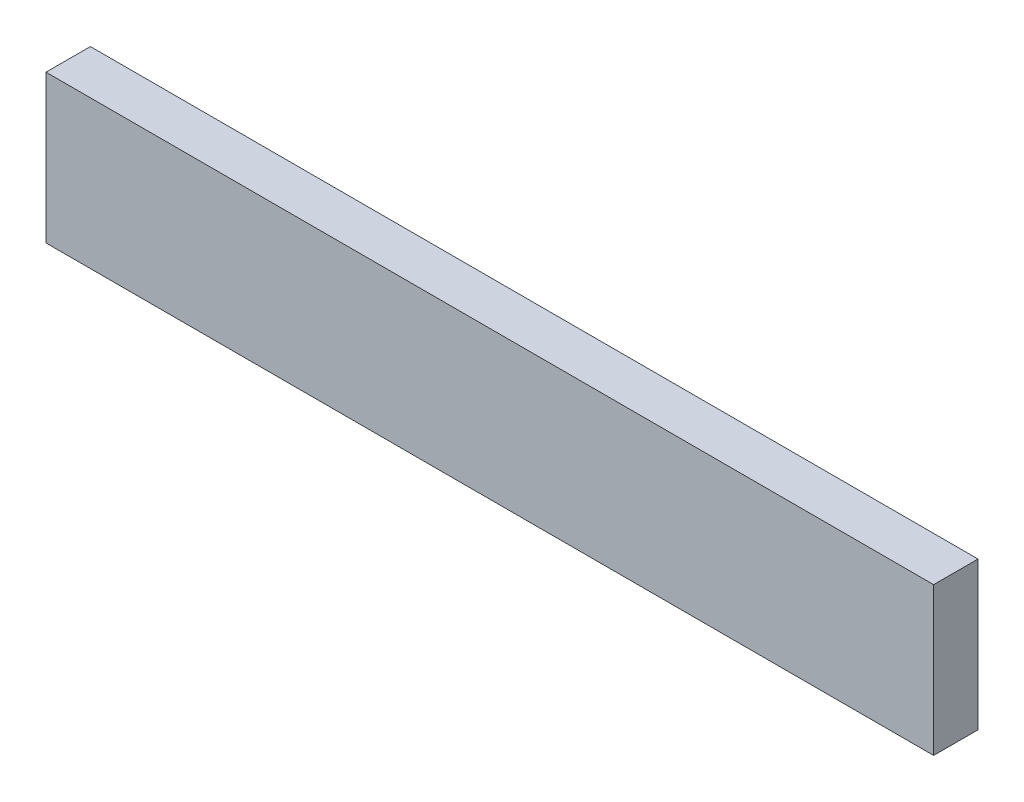
ISO-10303-21;
HEADER;
FILE_DESCRIPTION(('STEP AP214'),'2;1');
FILE_NAME('part.step','',(''),(''),'','','');
FILE_SCHEMA(('AUTOMOTIVE_DESIGN { 1 0 10303 214 1 1 1 1 }'));
ENDSEC;
DATA;
#1=APPLICATION_CONTEXT('core data for automotive mechanical design processes');
#2=APPLICATION_PROTOCOL_DEFINITION('international standard','automotive_design',2000,#1);
#3=PRODUCT_CONTEXT('',#1,'mechanical');
#4=PRODUCT('Part','Part','',(#3));
#5=PRODUCT_RELATED_PRODUCT_CATEGORY('part','',(#4));
#6=PRODUCT_DEFINITION_FORMATION('','',#4);
#7=PRODUCT_DEFINITION_CONTEXT('part definition',#1,'design');
#8=PRODUCT_DEFINITION('design','',#6,#7);
#9=PRODUCT_DEFINITION_SHAPE('','',#8);
#10=(LENGTH_UNIT() NAMED_UNIT(*) SI_UNIT(.MILLI.,.METRE.));
#11=(NAMED_UNIT(*) PLANE_ANGLE_UNIT() SI_UNIT($,.RADIAN.));
#12=(NAMED_UNIT(*) SI_UNIT($,.STERADIAN.) SOLID_ANGLE_UNIT());
#13=UNCERTAINTY_MEASURE_WITH_UNIT(LENGTH_MEASURE(1.E-05),#10,'distance_accuracy_value','');
#14=(GEOMETRIC_REPRESENTATION_CONTEXT(3) GLOBAL_UNCERTAINTY_ASSIGNED_CONTEXT((#13)) GLOBAL_UNIT_ASSIGNED_CONTEXT((#10,
#11,#12)) REPRESENTATION_CONTEXT('',''));
#15=CARTESIAN_POINT('',(0.,0.,0.));
#16=DIRECTION('',(0.,0.,1.));
#17=DIRECTION('',(1.,0.,0.));
#18=AXIS2_PLACEMENT_3D('',#15,#16,#17);
#19=CARTESIAN_POINT('',(-78.2360776336191,45.4028235027745,7.62));
#20=DIRECTION('',(1.,0.,0.));
#21=DIRECTION('',(0.,0.,-1.));
#22=AXIS2_PLACEMENT_3D('',#19,#20,#21);
#23=PLANE('',#22);
#24=DIRECTION('',(0.,-1.,0.));
#25=VECTOR('',#24,1.);
#26=CARTESIAN_POINT('',(-78.2360776336191,45.4028235027745,0.));
#27=LINE('',#26,#25);
#28=CARTESIAN_POINT('',(-78.2360776336191,45.4028235027745,0.));
#29=VERTEX_POINT('',#28);
#30=CARTESIAN_POINT('',(-78.2360776336191,20.0028235027746,0.));
#31=VERTEX_POINT('',#30);
#32=EDGE_CURVE('E96',#29,#31,#27,.T.);
#33=ORIENTED_EDGE('',*,*,#32,.T.);
#34=DIRECTION('',(0.,0.,-1.));
#35=VECTOR('',#34,1.);
#36=CARTESIAN_POINT('',(-78.2360776336191,20.0028235027746,7.62));
#37=LINE('',#36,#35);
#38=CARTESIAN_POINT('',(-78.2360776336191,20.0028235027746,7.62));
#39=VERTEX_POINT('',#38);
#40=EDGE_CURVE('E11',#39,#31,#37,.T.);
#41=ORIENTED_EDGE('',*,*,#40,.F.);
#42=DIRECTION('',(0.,-1.,0.));
#43=VECTOR('',#42,1.);
#44=CARTESIAN_POINT('',(-78.2360776336191,45.4028235027745,7.62));
#45=LINE('',#44,#43);
#46=CARTESIAN_POINT('',(-78.2360776336191,45.4028235027745,7.62));
#47=VERTEX_POINT('',#46);
#48=EDGE_CURVE('E84',#47,#39,#45,.T.);
#49=ORIENTED_EDGE('',*,*,#48,.F.);
#50=DIRECTION('',(0.,0.,-1.));
#51=VECTOR('',#50,1.);
#52=CARTESIAN_POINT('',(-78.2360776336191,45.4028235027745,7.62));
#53=LINE('',#52,#51);
#54=EDGE_CURVE('E92',#47,#29,#53,.T.);
#55=ORIENTED_EDGE('',*,*,#54,.T.);
#56=EDGE_LOOP('',(#33,#41,#49,#55));
#57=FACE_BOUND('',#56,.T.);
#58=ADVANCED_FACE('F33',(#57),#23,.F.);
#59=CARTESIAN_POINT('',(74.163922366381,20.0028235027746,7.62));
#60=DIRECTION('',(0.,1.,0.));
#61=DIRECTION('',(-1.,0.,0.));
#62=AXIS2_PLACEMENT_3D('',#59,#60,#61);
#63=PLANE('',#62);
#64=DIRECTION('',(1.,0.,0.));
#65=VECTOR('',#64,1.);
#66=CARTESIAN_POINT('',(74.163922366381,20.0028235027746,0.));
#67=LINE('',#66,#65);
#68=CARTESIAN_POINT('',(74.163922366381,20.0028235027746,0.));
#69=VERTEX_POINT('',#68);
#70=EDGE_CURVE('E88',#31,#69,#67,.T.);
#71=ORIENTED_EDGE('',*,*,#70,.T.);
#72=DIRECTION('',(0.,0.,-1.));
#73=VECTOR('',#72,1.);
#74=CARTESIAN_POINT('',(74.163922366381,20.0028235027746,7.62));
#75=LINE('',#74,#73);
#76=CARTESIAN_POINT('',(74.163922366381,20.0028235027746,7.62));
#77=VERTEX_POINT('',#76);
#78=EDGE_CURVE('E41',#77,#69,#75,.T.);
#79=ORIENTED_EDGE('',*,*,#78,.F.);
#80=DIRECTION('',(1.,0.,0.));
#81=VECTOR('',#80,1.);
#82=CARTESIAN_POINT('',(74.163922366381,20.0028235027746,7.62));
#83=LINE('',#82,#81);
#84=EDGE_CURVE('E79',#39,#77,#83,.T.);
#85=ORIENTED_EDGE('',*,*,#84,.F.);
#86=ORIENTED_EDGE('',*,*,#40,.T.);
#87=EDGE_LOOP('',(#71,#79,#85,#86));
#88=FACE_BOUND('',#87,.T.);
#89=ADVANCED_FACE('F87',(#88),#63,.F.);
#90=CARTESIAN_POINT('',(74.163922366381,45.4028235027746,7.62));
#91=DIRECTION('',(-1.,0.,0.));
#92=DIRECTION('',(0.,-1.,0.));
#93=AXIS2_PLACEMENT_3D('',#90,#91,#92);
#94=PLANE('',#93);
#95=DIRECTION('',(0.,1.,0.));
#96=VECTOR('',#95,1.);
#97=CARTESIAN_POINT('',(74.163922366381,45.4028235027746,0.));
#98=LINE('',#97,#96);
#99=CARTESIAN_POINT('',(74.163922366381,45.4028235027746,0.));
#100=VERTEX_POINT('',#99);
#101=EDGE_CURVE('E66',#69,#100,#98,.T.);
#102=ORIENTED_EDGE('',*,*,#101,.T.);
#103=DIRECTION('',(0.,0.,-1.));
#104=VECTOR('',#103,1.);
#105=CARTESIAN_POINT('',(74.163922366381,45.4028235027746,7.62));
#106=LINE('',#105,#104);
#107=CARTESIAN_POINT('',(74.163922366381,45.4028235027746,7.62));
#108=VERTEX_POINT('',#107);
#109=EDGE_CURVE('E89',#108,#100,#106,.T.);
#110=ORIENTED_EDGE('',*,*,#109,.F.);
#111=DIRECTION('',(0.,1.,0.));
#112=VECTOR('',#111,1.);
#113=CARTESIAN_POINT('',(74.163922366381,45.4028235027746,7.62));
#114=LINE('',#113,#112);
#115=EDGE_CURVE('E82',#77,#108,#114,.T.);
#116=ORIENTED_EDGE('',*,*,#115,.F.);
#117=ORIENTED_EDGE('',*,*,#78,.T.);
#118=EDGE_LOOP('',(#102,#110,#116,#117));
#119=FACE_BOUND('',#118,.T.);
#120=ADVANCED_FACE('F90',(#119),#94,.F.);
#121=CARTESIAN_POINT('',(-78.2360776336191,45.4028235027745,7.62));
#122=DIRECTION('',(0.,-1.,0.));
#123=DIRECTION('',(1.,0.,0.));
#124=AXIS2_PLACEMENT_3D('',#121,#122,#123);
#125=PLANE('',#124);
#126=DIRECTION('',(-1.,0.,0.));
#127=VECTOR('',#126,1.);
#128=CARTESIAN_POINT('',(-78.2360776336191,45.4028235027745,0.));
#129=LINE('',#128,#127);
#130=EDGE_CURVE('E72',#100,#29,#129,.T.);
#131=ORIENTED_EDGE('',*,*,#130,.T.);
#132=ORIENTED_EDGE('',*,*,#54,.F.);
#133=DIRECTION('',(-1.,0.,0.));
#134=VECTOR('',#133,1.);
#135=CARTESIAN_POINT('',(-78.2360776336191,45.4028235027745,7.62));
#136=LINE('',#135,#134);
#137=EDGE_CURVE('E49',#108,#47,#136,.T.);
#138=ORIENTED_EDGE('',*,*,#137,.F.);
#139=ORIENTED_EDGE('',*,*,#109,.T.);
#140=EDGE_LOOP('',(#131,#132,#138,#139));
#141=FACE_BOUND('',#140,.T.);
#142=ADVANCED_FACE('F103',(#141),#125,.F.);
#143=CARTESIAN_POINT('',(0.,0.,7.62));
#144=DIRECTION('',(0.,0.,-1.));
#145=DIRECTION('',(-1.,0.,0.));
#146=AXIS2_PLACEMENT_3D('',#143,#144,#145);
#147=PLANE('',#146);
#148=ORIENTED_EDGE('',*,*,#48,.T.);
#149=ORIENTED_EDGE('',*,*,#84,.T.);
#150=ORIENTED_EDGE('',*,*,#115,.T.);
#151=ORIENTED_EDGE('',*,*,#137,.T.);
#152=EDGE_LOOP('',(#148,#149,#150,#151));
#153=FACE_BOUND('',#152,.T.);
#154=ADVANCED_FACE('F80',(#153),#147,.F.);
#155=CARTESIAN_POINT('',(0.,0.,0.));
#156=DIRECTION('',(0.,0.,-1.));
#157=DIRECTION('',(-1.,0.,0.));
#158=AXIS2_PLACEMENT_3D('',#155,#156,#157);
#159=PLANE('',#158);
#160=ORIENTED_EDGE('',*,*,#32,.F.);
#161=ORIENTED_EDGE('',*,*,#130,.F.);
#162=ORIENTED_EDGE('',*,*,#101,.F.);
#163=ORIENTED_EDGE('',*,*,#70,.F.);
#164=EDGE_LOOP('',(#160,#161,#162,#163));
#165=FACE_BOUND('',#164,.T.);
#166=ADVANCED_FACE('F106',(#165),#159,.T.);
#167=CLOSED_SHELL('',(#58,#89,#120,#142,#154,#166));
#168=MANIFOLD_SOLID_BREP('B2',#167);
#169=ADVANCED_BREP_SHAPE_REPRESENTATION('',(#18,#168),#14);
#170=SHAPE_DEFINITION_REPRESENTATION(#9,#169);
ENDSEC;
END-ISO-10303-21;
